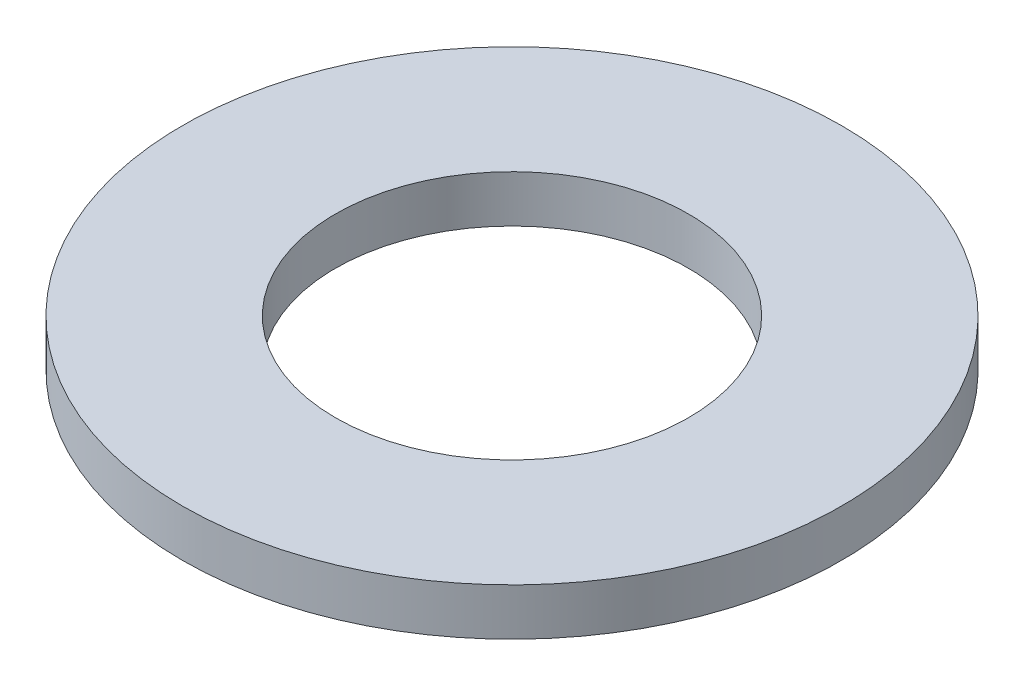
ISO-10303-21;
HEADER;
FILE_DESCRIPTION(('STEP AP214'),'2;1');
FILE_NAME('part.step','',(''),(''),'','','');
FILE_SCHEMA(('AUTOMOTIVE_DESIGN { 1 0 10303 214 1 1 1 1 }'));
ENDSEC;
DATA;
#1=APPLICATION_CONTEXT('core data for automotive mechanical design processes');
#2=APPLICATION_PROTOCOL_DEFINITION('international standard','automotive_design',2000,#1);
#3=PRODUCT_CONTEXT('',#1,'mechanical');
#4=PRODUCT('Part','Part','',(#3));
#5=PRODUCT_RELATED_PRODUCT_CATEGORY('part','',(#4));
#6=PRODUCT_DEFINITION_FORMATION('','',#4);
#7=PRODUCT_DEFINITION_CONTEXT('part definition',#1,'design');
#8=PRODUCT_DEFINITION('design','',#6,#7);
#9=PRODUCT_DEFINITION_SHAPE('','',#8);
#10=(LENGTH_UNIT() NAMED_UNIT(*) SI_UNIT(.MILLI.,.METRE.));
#11=(NAMED_UNIT(*) PLANE_ANGLE_UNIT() SI_UNIT($,.RADIAN.));
#12=(NAMED_UNIT(*) SI_UNIT($,.STERADIAN.) SOLID_ANGLE_UNIT());
#13=UNCERTAINTY_MEASURE_WITH_UNIT(LENGTH_MEASURE(1.E-05),#10,'distance_accuracy_value','');
#14=(GEOMETRIC_REPRESENTATION_CONTEXT(3) GLOBAL_UNCERTAINTY_ASSIGNED_CONTEXT((#13)) GLOBAL_UNIT_ASSIGNED_CONTEXT((#10,
#11,#12)) REPRESENTATION_CONTEXT('',''));
#15=CARTESIAN_POINT('',(0.,0.,0.));
#16=DIRECTION('',(0.,0.,1.));
#17=DIRECTION('',(1.,0.,0.));
#18=AXIS2_PLACEMENT_3D('',#15,#16,#17);
#19=CARTESIAN_POINT('',(0.,2.,0.));
#20=DIRECTION('',(0.,1.,0.));
#21=DIRECTION('',(0.,0.,1.));
#22=AXIS2_PLACEMENT_3D('',#19,#20,#21);
#23=PLANE('',#22);
#24=CARTESIAN_POINT('',(0.,2.,0.));
#25=DIRECTION('',(0.,1.,0.));
#26=DIRECTION('',(0.,0.,1.));
#27=AXIS2_PLACEMENT_3D('',#24,#25,#26);
#28=CIRCLE('',#27,14.);
#29=CARTESIAN_POINT('',(0.,2.,14.));
#30=VERTEX_POINT('',#29);
#31=EDGE_CURVE('E10',#30,#30,#28,.T.);
#32=ORIENTED_EDGE('',*,*,#31,.T.);
#33=EDGE_LOOP('',(#32));
#34=FACE_BOUND('',#33,.T.);
#35=CARTESIAN_POINT('',(0.,2.,0.));
#36=DIRECTION('',(0.,1.,0.));
#37=DIRECTION('',(0.,0.,1.));
#38=AXIS2_PLACEMENT_3D('',#35,#36,#37);
#39=CIRCLE('',#38,7.5);
#40=CARTESIAN_POINT('',(0.,2.,7.5));
#41=VERTEX_POINT('',#40);
#42=EDGE_CURVE('E50',#41,#41,#39,.T.);
#43=ORIENTED_EDGE('',*,*,#42,.F.);
#44=EDGE_LOOP('',(#43));
#45=FACE_BOUND('',#44,.T.);
#46=ADVANCED_FACE('F37',(#34,#45),#23,.T.);
#47=CARTESIAN_POINT('',(0.,0.,0.));
#48=DIRECTION('',(0.,1.,0.));
#49=DIRECTION('',(0.,0.,1.));
#50=AXIS2_PLACEMENT_3D('',#47,#48,#49);
#51=PLANE('',#50);
#52=CARTESIAN_POINT('',(0.,0.,0.));
#53=DIRECTION('',(0.,1.,0.));
#54=DIRECTION('',(0.,0.,1.));
#55=AXIS2_PLACEMENT_3D('',#52,#53,#54);
#56=CIRCLE('',#55,14.);
#57=CARTESIAN_POINT('',(0.,0.,14.));
#58=VERTEX_POINT('',#57);
#59=EDGE_CURVE('E41',#58,#58,#56,.T.);
#60=ORIENTED_EDGE('',*,*,#59,.F.);
#61=EDGE_LOOP('',(#60));
#62=FACE_BOUND('',#61,.T.);
#63=CARTESIAN_POINT('',(0.,0.,0.));
#64=DIRECTION('',(0.,1.,0.));
#65=DIRECTION('',(0.,0.,1.));
#66=AXIS2_PLACEMENT_3D('',#63,#64,#65);
#67=CIRCLE('',#66,7.5);
#68=CARTESIAN_POINT('',(0.,0.,7.5));
#69=VERTEX_POINT('',#68);
#70=EDGE_CURVE('E52',#69,#69,#67,.T.);
#71=ORIENTED_EDGE('',*,*,#70,.T.);
#72=EDGE_LOOP('',(#71));
#73=FACE_BOUND('',#72,.T.);
#74=ADVANCED_FACE('F64',(#62,#73),#51,.F.);
#75=CARTESIAN_POINT('',(0.,2.,0.));
#76=DIRECTION('',(0.,-1.,0.));
#77=DIRECTION('',(0.,0.,-1.));
#78=AXIS2_PLACEMENT_3D('',#75,#76,#77);
#79=CYLINDRICAL_SURFACE('',#78,14.);
#80=ORIENTED_EDGE('',*,*,#31,.F.);
#81=EDGE_LOOP('',(#80));
#82=FACE_BOUND('',#81,.T.);
#83=ORIENTED_EDGE('',*,*,#59,.T.);
#84=EDGE_LOOP('',(#83));
#85=FACE_BOUND('',#84,.T.);
#86=ADVANCED_FACE('F39',(#82,#85),#79,.T.);
#87=CARTESIAN_POINT('',(0.,2.,0.));
#88=DIRECTION('',(0.,-1.,0.));
#89=DIRECTION('',(0.,0.,-1.));
#90=AXIS2_PLACEMENT_3D('',#87,#88,#89);
#91=CYLINDRICAL_SURFACE('',#90,7.5);
#92=ORIENTED_EDGE('',*,*,#42,.T.);
#93=EDGE_LOOP('',(#92));
#94=FACE_BOUND('',#93,.T.);
#95=ORIENTED_EDGE('',*,*,#70,.F.);
#96=EDGE_LOOP('',(#95));
#97=FACE_BOUND('',#96,.T.);
#98=ADVANCED_FACE('F60',(#94,#97),#91,.F.);
#99=CLOSED_SHELL('',(#46,#74,#86,#98));
#100=MANIFOLD_SOLID_BREP('B2',#99);
#101=ADVANCED_BREP_SHAPE_REPRESENTATION('',(#18,#100),#14);
#102=SHAPE_DEFINITION_REPRESENTATION(#9,#101);
ENDSEC;
END-ISO-10303-21;
